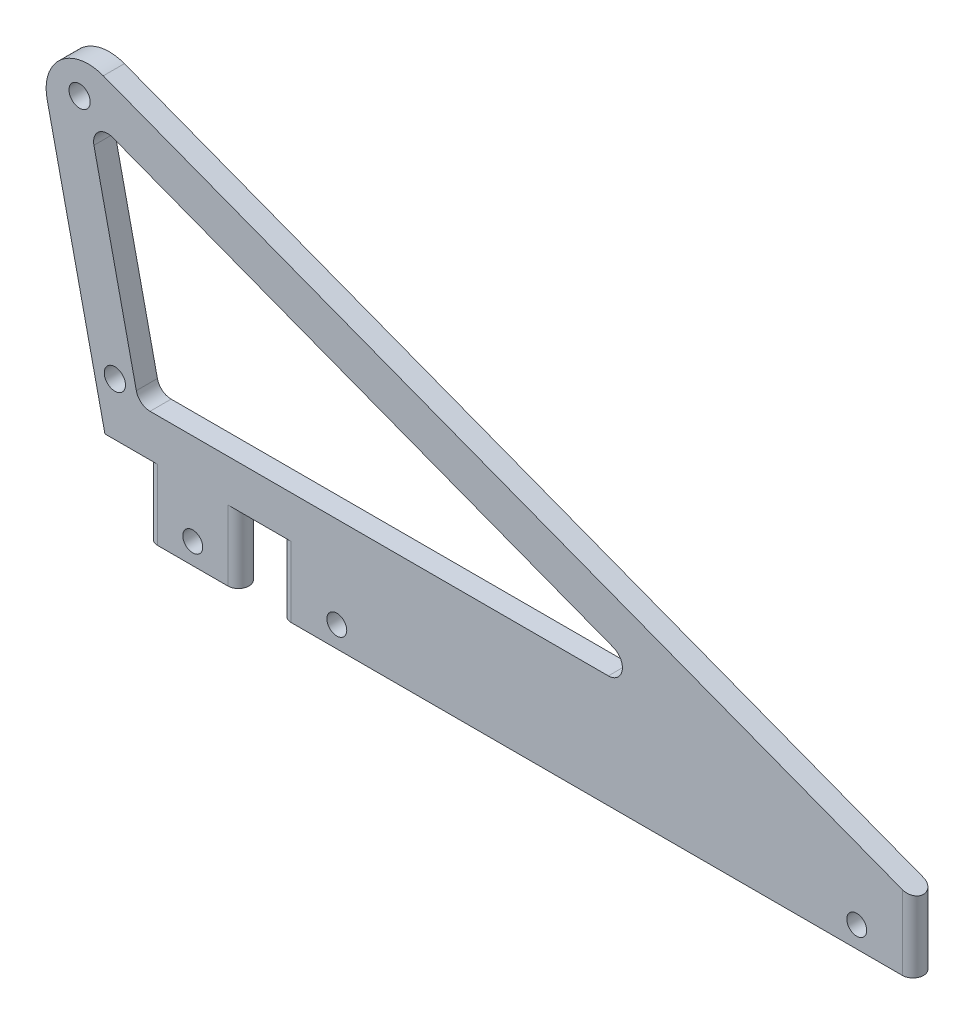
ISO-10303-21;
HEADER;
FILE_DESCRIPTION(('STEP AP214'),'2;1');
FILE_NAME('part.step','',(''),(''),'','','');
FILE_SCHEMA(('AUTOMOTIVE_DESIGN { 1 0 10303 214 1 1 1 1 }'));
ENDSEC;
DATA;
#1=APPLICATION_CONTEXT('core data for automotive mechanical design processes');
#2=APPLICATION_PROTOCOL_DEFINITION('international standard','automotive_design',2000,#1);
#3=PRODUCT_CONTEXT('',#1,'mechanical');
#4=PRODUCT('Part','Part','',(#3));
#5=PRODUCT_RELATED_PRODUCT_CATEGORY('part','',(#4));
#6=PRODUCT_DEFINITION_FORMATION('','',#4);
#7=PRODUCT_DEFINITION_CONTEXT('part definition',#1,'design');
#8=PRODUCT_DEFINITION('design','',#6,#7);
#9=PRODUCT_DEFINITION_SHAPE('','',#8);
#10=(LENGTH_UNIT() NAMED_UNIT(*) SI_UNIT(.MILLI.,.METRE.));
#11=(NAMED_UNIT(*) PLANE_ANGLE_UNIT() SI_UNIT($,.RADIAN.));
#12=(NAMED_UNIT(*) SI_UNIT($,.STERADIAN.) SOLID_ANGLE_UNIT());
#13=UNCERTAINTY_MEASURE_WITH_UNIT(LENGTH_MEASURE(1.E-05),#10,'distance_accuracy_value','');
#14=(GEOMETRIC_REPRESENTATION_CONTEXT(3) GLOBAL_UNCERTAINTY_ASSIGNED_CONTEXT((#13)) GLOBAL_UNIT_ASSIGNED_CONTEXT((#10,
#11,#12)) REPRESENTATION_CONTEXT('',''));
#15=CARTESIAN_POINT('',(0.,0.,0.));
#16=DIRECTION('',(0.,0.,1.));
#17=DIRECTION('',(1.,0.,0.));
#18=AXIS2_PLACEMENT_3D('',#15,#16,#17);
#19=CARTESIAN_POINT('',(180.18125,0.909732390125542,2.38125));
#20=DIRECTION('',(0.,1.,0.));
#21=DIRECTION('',(0.,0.,1.));
#22=AXIS2_PLACEMENT_3D('',#19,#20,#21);
#23=CYLINDRICAL_SURFACE('',#22,2.38125);
#24=DIRECTION('',(0.,1.,0.));
#25=VECTOR('',#24,1.);
#26=CARTESIAN_POINT('',(180.18125,0.,0.));
#27=LINE('',#26,#25);
#28=CARTESIAN_POINT('',(180.18125,0.909732390125538,0.));
#29=VERTEX_POINT('',#28);
#30=CARTESIAN_POINT('',(180.18125,-15.875,0.));
#31=VERTEX_POINT('',#30);
#32=EDGE_CURVE('E252',#29,#31,#27,.F.);
#33=ORIENTED_EDGE('',*,*,#32,.F.);
#34=CARTESIAN_POINT('',(180.18125,0.909732390125538,2.38125));
#35=DIRECTION('',(-0.356882282317649,-0.934149365234354,0.));
#36=DIRECTION('',(-0.934149365234354,0.356882282317649,0.));
#37=AXIS2_PLACEMENT_3D('',#34,#35,#36);
#38=ELLIPSE('',#37,2.5491105476506,2.38125);
#39=CARTESIAN_POINT('',(180.18125,0.909732390125538,4.7625));
#40=VERTEX_POINT('',#39);
#41=EDGE_CURVE('E43',#40,#29,#38,.F.);
#42=ORIENTED_EDGE('',*,*,#41,.F.);
#43=DIRECTION('',(0.,-1.,0.));
#44=VECTOR('',#43,1.);
#45=CARTESIAN_POINT('',(180.18125,0.909732390125542,4.7625));
#46=LINE('',#45,#44);
#47=CARTESIAN_POINT('',(180.18125,-15.875,4.7625));
#48=VERTEX_POINT('',#47);
#49=EDGE_CURVE('E255',#48,#40,#46,.F.);
#50=ORIENTED_EDGE('',*,*,#49,.F.);
#51=CARTESIAN_POINT('',(180.18125,-15.875,2.38125));
#52=DIRECTION('',(0.,1.,0.));
#53=DIRECTION('',(-1.,0.,0.));
#54=AXIS2_PLACEMENT_3D('',#51,#52,#53);
#55=CIRCLE('',#54,2.38125);
#56=EDGE_CURVE('E11',#31,#48,#55,.F.);
#57=ORIENTED_EDGE('',*,*,#56,.F.);
#58=EDGE_LOOP('',(#33,#42,#50,#57));
#59=FACE_BOUND('',#58,.T.);
#60=ADVANCED_FACE('F35',(#59),#23,.T.);
#61=CARTESIAN_POINT('',(42.06875,9.525,2.38125));
#62=DIRECTION('',(0.,-1.,0.));
#63=DIRECTION('',(0.,0.,-1.));
#64=AXIS2_PLACEMENT_3D('',#61,#62,#63);
#65=CYLINDRICAL_SURFACE('',#64,2.38125);
#66=DIRECTION('',(0.,1.,0.));
#67=VECTOR('',#66,1.);
#68=CARTESIAN_POINT('',(42.06875,9.525,4.7625));
#69=LINE('',#68,#67);
#70=CARTESIAN_POINT('',(42.06875,0.,4.7625));
#71=VERTEX_POINT('',#70);
#72=CARTESIAN_POINT('',(42.06875,-15.875,4.7625));
#73=VERTEX_POINT('',#72);
#74=EDGE_CURVE('E241',#71,#73,#69,.F.);
#75=ORIENTED_EDGE('',*,*,#74,.F.);
#76=CARTESIAN_POINT('',(42.06875,0.,2.38125));
#77=DIRECTION('',(0.,1.,0.));
#78=DIRECTION('',(0.,0.,1.));
#79=AXIS2_PLACEMENT_3D('',#76,#77,#78);
#80=CIRCLE('',#79,2.38125);
#81=CARTESIAN_POINT('',(42.06875,0.,0.));
#82=VERTEX_POINT('',#81);
#83=EDGE_CURVE('E249',#82,#71,#80,.T.);
#84=ORIENTED_EDGE('',*,*,#83,.F.);
#85=DIRECTION('',(0.,-1.,0.));
#86=VECTOR('',#85,1.);
#87=CARTESIAN_POINT('',(42.06875,0.,0.));
#88=LINE('',#87,#86);
#89=CARTESIAN_POINT('',(42.06875,-15.875,0.));
#90=VERTEX_POINT('',#89);
#91=EDGE_CURVE('E244',#90,#82,#88,.F.);
#92=ORIENTED_EDGE('',*,*,#91,.F.);
#93=CARTESIAN_POINT('',(42.06875,-15.875,2.38125));
#94=DIRECTION('',(0.,1.,0.));
#95=DIRECTION('',(-1.,0.,0.));
#96=AXIS2_PLACEMENT_3D('',#93,#94,#95);
#97=CIRCLE('',#96,2.38125);
#98=EDGE_CURVE('E247',#73,#90,#97,.F.);
#99=ORIENTED_EDGE('',*,*,#98,.F.);
#100=EDGE_LOOP('',(#75,#84,#92,#99));
#101=FACE_BOUND('',#100,.T.);
#102=ADVANCED_FACE('F381',(#101),#65,.T.);
#103=CARTESIAN_POINT('',(27.78125,9.525,2.38125));
#104=DIRECTION('',(0.,1.,0.));
#105=DIRECTION('',(0.,0.,1.));
#106=AXIS2_PLACEMENT_3D('',#103,#104,#105);
#107=CYLINDRICAL_SURFACE('',#106,2.38125);
#108=DIRECTION('',(0.,1.,0.));
#109=VECTOR('',#108,1.);
#110=CARTESIAN_POINT('',(27.78125,0.,0.));
#111=LINE('',#110,#109);
#112=CARTESIAN_POINT('',(27.78125,0.,0.));
#113=VERTEX_POINT('',#112);
#114=CARTESIAN_POINT('',(27.78125,-15.875,0.));
#115=VERTEX_POINT('',#114);
#116=EDGE_CURVE('E230',#113,#115,#111,.F.);
#117=ORIENTED_EDGE('',*,*,#116,.F.);
#118=CARTESIAN_POINT('',(27.78125,0.,2.38125));
#119=DIRECTION('',(0.,1.,0.));
#120=DIRECTION('',(0.,0.,1.));
#121=AXIS2_PLACEMENT_3D('',#118,#119,#120);
#122=CIRCLE('',#121,2.38125);
#123=CARTESIAN_POINT('',(27.78125,0.,4.7625));
#124=VERTEX_POINT('',#123);
#125=EDGE_CURVE('E238',#124,#113,#122,.T.);
#126=ORIENTED_EDGE('',*,*,#125,.F.);
#127=DIRECTION('',(0.,-1.,0.));
#128=VECTOR('',#127,1.);
#129=CARTESIAN_POINT('',(27.78125,9.525,4.7625));
#130=LINE('',#129,#128);
#131=CARTESIAN_POINT('',(27.78125,-15.875,4.7625));
#132=VERTEX_POINT('',#131);
#133=EDGE_CURVE('E233',#132,#124,#130,.F.);
#134=ORIENTED_EDGE('',*,*,#133,.F.);
#135=CARTESIAN_POINT('',(27.78125,-15.875,2.38125));
#136=DIRECTION('',(0.,1.,0.));
#137=DIRECTION('',(0.,0.,1.));
#138=AXIS2_PLACEMENT_3D('',#135,#136,#137);
#139=CIRCLE('',#138,2.38125);
#140=EDGE_CURVE('E236',#115,#132,#139,.F.);
#141=ORIENTED_EDGE('',*,*,#140,.F.);
#142=EDGE_LOOP('',(#117,#126,#134,#141));
#143=FACE_BOUND('',#142,.T.);
#144=ADVANCED_FACE('F385',(#143),#107,.T.);
#145=CARTESIAN_POINT('',(11.90625,9.525,2.38125));
#146=DIRECTION('',(0.,-1.,0.));
#147=DIRECTION('',(0.,0.,-1.));
#148=AXIS2_PLACEMENT_3D('',#145,#146,#147);
#149=CYLINDRICAL_SURFACE('',#148,2.38125);
#150=DIRECTION('',(0.,1.,0.));
#151=VECTOR('',#150,1.);
#152=CARTESIAN_POINT('',(11.90625,9.525,4.7625));
#153=LINE('',#152,#151);
#154=CARTESIAN_POINT('',(11.90625,0.,4.7625));
#155=VERTEX_POINT('',#154);
#156=CARTESIAN_POINT('',(11.90625,-15.875,4.7625));
#157=VERTEX_POINT('',#156);
#158=EDGE_CURVE('E222',#155,#157,#153,.F.);
#159=ORIENTED_EDGE('',*,*,#158,.F.);
#160=CARTESIAN_POINT('',(11.90625,0.,2.38125));
#161=DIRECTION('',(0.,1.,0.));
#162=DIRECTION('',(0.,0.,1.));
#163=AXIS2_PLACEMENT_3D('',#160,#161,#162);
#164=CIRCLE('',#163,2.38125);
#165=CARTESIAN_POINT('',(11.90625,0.,0.));
#166=VERTEX_POINT('',#165);
#167=EDGE_CURVE('E171',#166,#155,#164,.T.);
#168=ORIENTED_EDGE('',*,*,#167,.F.);
#169=DIRECTION('',(0.,-1.,0.));
#170=VECTOR('',#169,1.);
#171=CARTESIAN_POINT('',(11.90625,0.,0.));
#172=LINE('',#171,#170);
#173=CARTESIAN_POINT('',(11.90625,-15.875,0.));
#174=VERTEX_POINT('',#173);
#175=EDGE_CURVE('E224',#174,#166,#172,.F.);
#176=ORIENTED_EDGE('',*,*,#175,.F.);
#177=CARTESIAN_POINT('',(11.90625,-15.875,2.38125));
#178=DIRECTION('',(0.,1.,0.));
#179=DIRECTION('',(0.,0.,1.));
#180=AXIS2_PLACEMENT_3D('',#177,#178,#179);
#181=CIRCLE('',#180,2.38125);
#182=EDGE_CURVE('E227',#157,#174,#181,.F.);
#183=ORIENTED_EDGE('',*,*,#182,.F.);
#184=EDGE_LOOP('',(#159,#168,#176,#183));
#185=FACE_BOUND('',#184,.T.);
#186=ADVANCED_FACE('F390',(#185),#149,.T.);
#187=CARTESIAN_POINT('',(-16.8931332933918,76.2,4.7625));
#188=DIRECTION('',(0.976296007119934,0.2164396139381,0.));
#189=DIRECTION('',(-0.2164396139381,0.976296007119934,0.));
#190=AXIS2_PLACEMENT_3D('',#187,#188,#189);
#191=PLANE('',#190);
#192=DIRECTION('',(0.2164396139381,-0.976296007119934,0.));
#193=VECTOR('',#192,1.);
#194=CARTESIAN_POINT('',(-16.8931332933918,76.2,4.7625));
#195=LINE('',#194,#193);
#196=CARTESIAN_POINT('',(-13.0636416980499,58.9262796961887,4.7625));
#197=VERTEX_POINT('',#196);
#198=CARTESIAN_POINT('',(0.,0.,4.7625));
#199=VERTEX_POINT('',#198);
#200=EDGE_CURVE('E151',#197,#199,#195,.T.);
#201=ORIENTED_EDGE('',*,*,#200,.F.);
#202=DIRECTION('',(0.,0.,-1.));
#203=VECTOR('',#202,1.);
#204=CARTESIAN_POINT('',(-13.0636416980499,58.9262796961887,4.7625));
#205=LINE('',#204,#203);
#206=CARTESIAN_POINT('',(-13.0636416980499,58.9262796961887,0.));
#207=VERTEX_POINT('',#206);
#208=EDGE_CURVE('E213',#197,#207,#205,.T.);
#209=ORIENTED_EDGE('',*,*,#208,.T.);
#210=DIRECTION('',(0.2164396139381,-0.976296007119934,0.));
#211=VECTOR('',#210,1.);
#212=CARTESIAN_POINT('',(-16.8931332933918,76.2,0.));
#213=LINE('',#212,#211);
#214=CARTESIAN_POINT('',(0.,0.,0.));
#215=VERTEX_POINT('',#214);
#216=EDGE_CURVE('E177',#207,#215,#213,.T.);
#217=ORIENTED_EDGE('',*,*,#216,.T.);
#218=DIRECTION('',(0.,0.,-1.));
#219=VECTOR('',#218,1.);
#220=CARTESIAN_POINT('',(0.,0.,4.7625));
#221=LINE('',#220,#219);
#222=EDGE_CURVE('E169',#199,#215,#221,.T.);
#223=ORIENTED_EDGE('',*,*,#222,.F.);
#224=EDGE_LOOP('',(#201,#209,#217,#223));
#225=FACE_BOUND('',#224,.T.);
#226=ADVANCED_FACE('F175',(#225),#191,.F.);
#227=CARTESIAN_POINT('',(0.,0.,4.7625));
#228=DIRECTION('',(0.,1.,0.));
#229=DIRECTION('',(0.,0.,1.));
#230=AXIS2_PLACEMENT_3D('',#227,#228,#229);
#231=PLANE('',#230);
#232=DIRECTION('',(1.,0.,0.));
#233=VECTOR('',#232,1.);
#234=CARTESIAN_POINT('',(0.,0.,0.));
#235=LINE('',#234,#233);
#236=EDGE_CURVE('E271',#215,#166,#235,.T.);
#237=ORIENTED_EDGE('',*,*,#236,.T.);
#238=ORIENTED_EDGE('',*,*,#167,.T.);
#239=DIRECTION('',(1.,0.,0.));
#240=VECTOR('',#239,1.);
#241=CARTESIAN_POINT('',(0.,0.,4.7625));
#242=LINE('',#241,#240);
#243=EDGE_CURVE('E156',#199,#155,#242,.T.);
#244=ORIENTED_EDGE('',*,*,#243,.F.);
#245=ORIENTED_EDGE('',*,*,#222,.T.);
#246=EDGE_LOOP('',(#237,#238,#244,#245));
#247=FACE_BOUND('',#246,.T.);
#248=ADVANCED_FACE('F168',(#247),#231,.F.);
#249=CARTESIAN_POINT('',(9.525,-15.875,4.7625));
#250=DIRECTION('',(0.,1.,0.));
#251=DIRECTION('',(0.,0.,1.));
#252=AXIS2_PLACEMENT_3D('',#249,#250,#251);
#253=PLANE('',#252);
#254=DIRECTION('',(1.,0.,0.));
#255=VECTOR('',#254,1.);
#256=CARTESIAN_POINT('',(9.525,-15.875,0.));
#257=LINE('',#256,#255);
#258=EDGE_CURVE('E266',#174,#115,#257,.T.);
#259=ORIENTED_EDGE('',*,*,#258,.T.);
#260=ORIENTED_EDGE('',*,*,#140,.T.);
#261=DIRECTION('',(1.,0.,0.));
#262=VECTOR('',#261,1.);
#263=CARTESIAN_POINT('',(9.525,-15.875,4.7625));
#264=LINE('',#263,#262);
#265=EDGE_CURVE('E173',#157,#132,#264,.T.);
#266=ORIENTED_EDGE('',*,*,#265,.F.);
#267=ORIENTED_EDGE('',*,*,#182,.T.);
#268=EDGE_LOOP('',(#259,#260,#266,#267));
#269=FACE_BOUND('',#268,.T.);
#270=ADVANCED_FACE('F413',(#269),#253,.F.);
#271=CARTESIAN_POINT('',(30.1625,0.,4.7625));
#272=DIRECTION('',(0.,1.,0.));
#273=DIRECTION('',(0.,0.,1.));
#274=AXIS2_PLACEMENT_3D('',#271,#272,#273);
#275=PLANE('',#274);
#276=DIRECTION('',(1.,0.,0.));
#277=VECTOR('',#276,1.);
#278=CARTESIAN_POINT('',(30.1625,0.,0.));
#279=LINE('',#278,#277);
#280=EDGE_CURVE('E265',#113,#82,#279,.T.);
#281=ORIENTED_EDGE('',*,*,#280,.T.);
#282=ORIENTED_EDGE('',*,*,#83,.T.);
#283=DIRECTION('',(1.,0.,0.));
#284=VECTOR('',#283,1.);
#285=CARTESIAN_POINT('',(30.1625,0.,4.7625));
#286=LINE('',#285,#284);
#287=EDGE_CURVE('E276',#124,#71,#286,.T.);
#288=ORIENTED_EDGE('',*,*,#287,.F.);
#289=ORIENTED_EDGE('',*,*,#125,.T.);
#290=EDGE_LOOP('',(#281,#282,#288,#289));
#291=FACE_BOUND('',#290,.T.);
#292=ADVANCED_FACE('F420',(#291),#275,.F.);
#293=CARTESIAN_POINT('',(39.6875,-15.875,4.7625));
#294=DIRECTION('',(0.,1.,0.));
#295=DIRECTION('',(-1.,0.,0.));
#296=AXIS2_PLACEMENT_3D('',#293,#294,#295);
#297=PLANE('',#296);
#298=DIRECTION('',(1.,0.,0.));
#299=VECTOR('',#298,1.);
#300=CARTESIAN_POINT('',(39.6875,-15.875,0.));
#301=LINE('',#300,#299);
#302=EDGE_CURVE('E264',#90,#31,#301,.T.);
#303=ORIENTED_EDGE('',*,*,#302,.T.);
#304=ORIENTED_EDGE('',*,*,#56,.T.);
#305=DIRECTION('',(1.,0.,0.));
#306=VECTOR('',#305,1.);
#307=CARTESIAN_POINT('',(39.6875,-15.875,4.7625));
#308=LINE('',#307,#306);
#309=EDGE_CURVE('E184',#73,#48,#308,.T.);
#310=ORIENTED_EDGE('',*,*,#309,.F.);
#311=ORIENTED_EDGE('',*,*,#98,.T.);
#312=EDGE_LOOP('',(#303,#304,#310,#311));
#313=FACE_BOUND('',#312,.T.);
#314=ADVANCED_FACE('F422',(#313),#297,.F.);
#315=CARTESIAN_POINT('',(182.5625,0.,4.7625));
#316=DIRECTION('',(-0.356882282317649,-0.934149365234354,0.));
#317=DIRECTION('',(0.934149365234354,-0.356882282317649,0.));
#318=AXIS2_PLACEMENT_3D('',#315,#316,#317);
#319=PLANE('',#318);
#320=DIRECTION('',(-0.934149365234354,0.356882282317649,0.));
#321=VECTOR('',#320,1.);
#322=CARTESIAN_POINT('',(182.5625,0.,4.7625));
#323=LINE('',#322,#321);
#324=CARTESIAN_POINT('',(-0.365118491156918,69.8856397228063,4.7625));
#325=VERTEX_POINT('',#324);
#326=EDGE_CURVE('E180',#40,#325,#323,.T.);
#327=ORIENTED_EDGE('',*,*,#326,.F.);
#328=ORIENTED_EDGE('',*,*,#41,.T.);
#329=DIRECTION('',(-0.934149365234354,0.356882282317649,0.));
#330=VECTOR('',#329,1.);
#331=CARTESIAN_POINT('',(182.5625,0.,0.));
#332=LINE('',#331,#330);
#333=CARTESIAN_POINT('',(-0.365118491156918,69.8856397228063,0.));
#334=VERTEX_POINT('',#333);
#335=EDGE_CURVE('E164',#29,#334,#332,.T.);
#336=ORIENTED_EDGE('',*,*,#335,.T.);
#337=DIRECTION('',(0.,0.,-1.));
#338=VECTOR('',#337,1.);
#339=CARTESIAN_POINT('',(-0.365118491156918,69.8856397228063,4.7625));
#340=LINE('',#339,#338);
#341=EDGE_CURVE('E218',#334,#325,#340,.F.);
#342=ORIENTED_EDGE('',*,*,#341,.T.);
#343=EDGE_LOOP('',(#327,#328,#336,#342));
#344=FACE_BOUND('',#343,.T.);
#345=ADVANCED_FACE('F258',(#344),#319,.F.);
#346=CARTESIAN_POINT('',(0.,0.,4.7625));
#347=DIRECTION('',(0.,0.,1.));
#348=DIRECTION('',(1.,0.,0.));
#349=AXIS2_PLACEMENT_3D('',#346,#347,#348);
#350=PLANE('',#349);
#351=CARTESIAN_POINT('',(19.84375,-11.1125,4.7625));
#352=DIRECTION('',(0.,0.,1.));
#353=DIRECTION('',(1.,0.,0.));
#354=AXIS2_PLACEMENT_3D('',#351,#352,#353);
#355=CIRCLE('',#354,2.2479);
#356=CARTESIAN_POINT('',(22.09165,-11.1125,4.7625));
#357=VERTEX_POINT('',#356);
#358=EDGE_CURVE('E324',#357,#357,#355,.T.);
#359=ORIENTED_EDGE('',*,*,#358,.F.);
#360=EDGE_LOOP('',(#359));
#361=FACE_BOUND('',#360,.T.);
#362=CARTESIAN_POINT('',(52.3875,-11.1125,4.7625));
#363=DIRECTION('',(0.,0.,1.));
#364=DIRECTION('',(1.,0.,0.));
#365=AXIS2_PLACEMENT_3D('',#362,#363,#364);
#366=CIRCLE('',#365,2.2479);
#367=CARTESIAN_POINT('',(54.6354,-11.1125,4.7625));
#368=VERTEX_POINT('',#367);
#369=EDGE_CURVE('E318',#368,#368,#366,.T.);
#370=ORIENTED_EDGE('',*,*,#369,.F.);
#371=EDGE_LOOP('',(#370));
#372=FACE_BOUND('',#371,.T.);
#373=CARTESIAN_POINT('',(169.8625,-11.1125,4.7625));
#374=DIRECTION('',(0.,0.,1.));
#375=DIRECTION('',(1.,0.,0.));
#376=AXIS2_PLACEMENT_3D('',#373,#374,#375);
#377=CIRCLE('',#376,2.2479);
#378=CARTESIAN_POINT('',(172.1104,-11.1125,4.7625));
#379=VERTEX_POINT('',#378);
#380=EDGE_CURVE('E312',#379,#379,#377,.T.);
#381=ORIENTED_EDGE('',*,*,#380,.F.);
#382=EDGE_LOOP('',(#381));
#383=FACE_BOUND('',#382,.T.);
#384=CARTESIAN_POINT('',(-5.72515332999664,63.2597505333476,4.7625));
#385=DIRECTION('',(0.,0.,1.));
#386=DIRECTION('',(1.,0.,0.));
#387=AXIS2_PLACEMENT_3D('',#384,#385,#386);
#388=CIRCLE('',#387,2.4003);
#389=CARTESIAN_POINT('',(-3.32485332999664,63.2597505333476,4.7625));
#390=VERTEX_POINT('',#389);
#391=EDGE_CURVE('E306',#390,#390,#388,.T.);
#392=ORIENTED_EDGE('',*,*,#391,.F.);
#393=EDGE_LOOP('',(#392));
#394=FACE_BOUND('',#393,.T.);
#395=CARTESIAN_POINT('',(2.24442452402155,11.8798830405005,4.7625));
#396=DIRECTION('',(0.,0.,1.));
#397=DIRECTION('',(1.,0.,0.));
#398=AXIS2_PLACEMENT_3D('',#395,#396,#397);
#399=CIRCLE('',#398,2.4003);
#400=CARTESIAN_POINT('',(4.64472452402155,11.8798830405005,4.7625));
#401=VERTEX_POINT('',#400);
#402=EDGE_CURVE('E300',#401,#401,#399,.T.);
#403=ORIENTED_EDGE('',*,*,#402,.F.);
#404=EDGE_LOOP('',(#403));
#405=FACE_BOUND('',#404,.T.);
#406=DIRECTION('',(0.2164396139381,-0.976296007119934,0.));
#407=VECTOR('',#406,1.);
#408=CARTESIAN_POINT('',(-3.7644222302325,60.9878670189491,4.7625));
#409=LINE('',#408,#407);
#410=CARTESIAN_POINT('',(-2.48792503178521,55.229960251012,4.7625));
#411=VERTEX_POINT('',#410);
#412=CARTESIAN_POINT('',(7.09308779362317,12.0128042257465,4.7625));
#413=VERTEX_POINT('',#412);
#414=EDGE_CURVE('E287',#411,#413,#409,.T.);
#415=ORIENTED_EDGE('',*,*,#414,.F.);
#416=CARTESIAN_POINT('',(0.611814790820582,55.9171560252655,4.7625));
#417=DIRECTION('',(0.,0.,1.));
#418=DIRECTION('',(1.,0.,0.));
#419=AXIS2_PLACEMENT_3D('',#416,#417,#418);
#420=CIRCLE('',#419,3.175);
#421=CARTESIAN_POINT('',(1.74491603717908,58.8830802598846,4.7625));
#422=VERTEX_POINT('',#421);
#423=EDGE_CURVE('E209',#411,#422,#420,.F.);
#424=ORIENTED_EDGE('',*,*,#423,.T.);
#425=DIRECTION('',(-0.934149365234354,0.356882282317649,0.));
#426=VECTOR('',#425,1.);
#427=CARTESIAN_POINT('',(130.941072945071,9.525,4.7625));
#428=LINE('',#427,#426);
#429=CARTESIAN_POINT('',(114.867031839786,15.6659242346191,4.7625));
#430=VERTEX_POINT('',#429);
#431=EDGE_CURVE('E280',#430,#422,#428,.T.);
#432=ORIENTED_EDGE('',*,*,#431,.F.);
#433=CARTESIAN_POINT('',(113.733930593428,12.7,4.7625));
#434=DIRECTION('',(0.,0.,1.));
#435=DIRECTION('',(1.,0.,0.));
#436=AXIS2_PLACEMENT_3D('',#433,#434,#435);
#437=CIRCLE('',#436,3.175);
#438=CARTESIAN_POINT('',(113.733930593428,9.525,4.7625));
#439=VERTEX_POINT('',#438);
#440=EDGE_CURVE('E205',#430,#439,#437,.F.);
#441=ORIENTED_EDGE('',*,*,#440,.T.);
#442=DIRECTION('',(1.,0.,0.));
#443=VECTOR('',#442,1.);
#444=CARTESIAN_POINT('',(7.64462071217172,9.525,4.7625));
#445=LINE('',#444,#443);
#446=CARTESIAN_POINT('',(10.192827616229,9.525,4.7625));
#447=VERTEX_POINT('',#446);
#448=EDGE_CURVE('E284',#447,#439,#445,.T.);
#449=ORIENTED_EDGE('',*,*,#448,.F.);
#450=CARTESIAN_POINT('',(10.192827616229,12.7,4.7625));
#451=DIRECTION('',(0.,0.,1.));
#452=DIRECTION('',(1.,0.,0.));
#453=AXIS2_PLACEMENT_3D('',#450,#451,#452);
#454=CIRCLE('',#453,3.175);
#455=EDGE_CURVE('E201',#447,#413,#454,.F.);
#456=ORIENTED_EDGE('',*,*,#455,.T.);
#457=EDGE_LOOP('',(#415,#424,#432,#441,#449,#456));
#458=FACE_BOUND('',#457,.T.);
#459=ORIENTED_EDGE('',*,*,#309,.T.);
#460=ORIENTED_EDGE('',*,*,#49,.T.);
#461=ORIENTED_EDGE('',*,*,#326,.T.);
#462=CARTESIAN_POINT('',(-3.76442223023252,60.9878670189491,4.7625));
#463=DIRECTION('',(0.,0.,1.));
#464=DIRECTION('',(1.,0.,0.));
#465=AXIS2_PLACEMENT_3D('',#462,#463,#464);
#466=CIRCLE('',#465,9.525);
#467=EDGE_CURVE('E159',#325,#197,#466,.T.);
#468=ORIENTED_EDGE('',*,*,#467,.T.);
#469=ORIENTED_EDGE('',*,*,#200,.T.);
#470=ORIENTED_EDGE('',*,*,#243,.T.);
#471=ORIENTED_EDGE('',*,*,#158,.T.);
#472=ORIENTED_EDGE('',*,*,#265,.T.);
#473=ORIENTED_EDGE('',*,*,#133,.T.);
#474=ORIENTED_EDGE('',*,*,#287,.T.);
#475=ORIENTED_EDGE('',*,*,#74,.T.);
#476=EDGE_LOOP('',(#459,#460,#461,#468,#469,#470,#471,#472,#473,#474,#475));
#477=FACE_BOUND('',#476,.T.);
#478=ADVANCED_FACE('F154',(#361,#372,#383,#394,#405,#458,#477),#350,.T.);
#479=CARTESIAN_POINT('',(0.,0.,0.));
#480=DIRECTION('',(0.,0.,1.));
#481=DIRECTION('',(1.,0.,0.));
#482=AXIS2_PLACEMENT_3D('',#479,#480,#481);
#483=PLANE('',#482);
#484=CARTESIAN_POINT('',(19.84375,-11.1125,0.));
#485=DIRECTION('',(0.,0.,1.));
#486=DIRECTION('',(1.,0.,0.));
#487=AXIS2_PLACEMENT_3D('',#484,#485,#486);
#488=CIRCLE('',#487,2.2479);
#489=CARTESIAN_POINT('',(22.09165,-11.1125,0.));
#490=VERTEX_POINT('',#489);
#491=EDGE_CURVE('E321',#490,#490,#488,.T.);
#492=ORIENTED_EDGE('',*,*,#491,.T.);
#493=EDGE_LOOP('',(#492));
#494=FACE_BOUND('',#493,.T.);
#495=CARTESIAN_POINT('',(52.3875,-11.1125,0.));
#496=DIRECTION('',(0.,0.,1.));
#497=DIRECTION('',(1.,0.,0.));
#498=AXIS2_PLACEMENT_3D('',#495,#496,#497);
#499=CIRCLE('',#498,2.2479);
#500=CARTESIAN_POINT('',(54.6354,-11.1125,0.));
#501=VERTEX_POINT('',#500);
#502=EDGE_CURVE('E315',#501,#501,#499,.T.);
#503=ORIENTED_EDGE('',*,*,#502,.T.);
#504=EDGE_LOOP('',(#503));
#505=FACE_BOUND('',#504,.T.);
#506=CARTESIAN_POINT('',(169.8625,-11.1125,0.));
#507=DIRECTION('',(0.,0.,1.));
#508=DIRECTION('',(1.,0.,0.));
#509=AXIS2_PLACEMENT_3D('',#506,#507,#508);
#510=CIRCLE('',#509,2.2479);
#511=CARTESIAN_POINT('',(172.1104,-11.1125,0.));
#512=VERTEX_POINT('',#511);
#513=EDGE_CURVE('E309',#512,#512,#510,.T.);
#514=ORIENTED_EDGE('',*,*,#513,.T.);
#515=EDGE_LOOP('',(#514));
#516=FACE_BOUND('',#515,.T.);
#517=CARTESIAN_POINT('',(-5.72515332999664,63.2597505333476,0.));
#518=DIRECTION('',(0.,0.,1.));
#519=DIRECTION('',(1.,0.,0.));
#520=AXIS2_PLACEMENT_3D('',#517,#518,#519);
#521=CIRCLE('',#520,2.4003);
#522=CARTESIAN_POINT('',(-3.32485332999664,63.2597505333476,0.));
#523=VERTEX_POINT('',#522);
#524=EDGE_CURVE('E303',#523,#523,#521,.T.);
#525=ORIENTED_EDGE('',*,*,#524,.T.);
#526=EDGE_LOOP('',(#525));
#527=FACE_BOUND('',#526,.T.);
#528=CARTESIAN_POINT('',(2.24442452402155,11.8798830405005,0.));
#529=DIRECTION('',(0.,0.,1.));
#530=DIRECTION('',(1.,0.,0.));
#531=AXIS2_PLACEMENT_3D('',#528,#529,#530);
#532=CIRCLE('',#531,2.4003);
#533=CARTESIAN_POINT('',(4.64472452402155,11.8798830405005,0.));
#534=VERTEX_POINT('',#533);
#535=EDGE_CURVE('E290',#534,#534,#532,.T.);
#536=ORIENTED_EDGE('',*,*,#535,.T.);
#537=EDGE_LOOP('',(#536));
#538=FACE_BOUND('',#537,.T.);
#539=DIRECTION('',(1.,0.,0.));
#540=VECTOR('',#539,1.);
#541=CARTESIAN_POINT('',(7.64462071217172,9.525,0.));
#542=LINE('',#541,#540);
#543=CARTESIAN_POINT('',(10.192827616229,9.525,0.));
#544=VERTEX_POINT('',#543);
#545=CARTESIAN_POINT('',(113.733930593428,9.525,0.));
#546=VERTEX_POINT('',#545);
#547=EDGE_CURVE('E293',#544,#546,#542,.T.);
#548=ORIENTED_EDGE('',*,*,#547,.T.);
#549=CARTESIAN_POINT('',(113.733930593428,12.7,0.));
#550=DIRECTION('',(0.,0.,1.));
#551=DIRECTION('',(1.,0.,0.));
#552=AXIS2_PLACEMENT_3D('',#549,#550,#551);
#553=CIRCLE('',#552,3.175);
#554=CARTESIAN_POINT('',(114.867031839786,15.6659242346191,0.));
#555=VERTEX_POINT('',#554);
#556=EDGE_CURVE('E207',#546,#555,#553,.T.);
#557=ORIENTED_EDGE('',*,*,#556,.T.);
#558=DIRECTION('',(-0.934149365234354,0.356882282317649,0.));
#559=VECTOR('',#558,1.);
#560=CARTESIAN_POINT('',(130.941072945071,9.525,0.));
#561=LINE('',#560,#559);
#562=CARTESIAN_POINT('',(1.74491603717908,58.8830802598846,0.));
#563=VERTEX_POINT('',#562);
#564=EDGE_CURVE('E273',#555,#563,#561,.T.);
#565=ORIENTED_EDGE('',*,*,#564,.T.);
#566=CARTESIAN_POINT('',(0.611814790820582,55.9171560252655,0.));
#567=DIRECTION('',(0.,0.,1.));
#568=DIRECTION('',(1.,0.,0.));
#569=AXIS2_PLACEMENT_3D('',#566,#567,#568);
#570=CIRCLE('',#569,3.175);
#571=CARTESIAN_POINT('',(-2.48792503178521,55.229960251012,0.));
#572=VERTEX_POINT('',#571);
#573=EDGE_CURVE('E211',#563,#572,#570,.T.);
#574=ORIENTED_EDGE('',*,*,#573,.T.);
#575=DIRECTION('',(0.2164396139381,-0.976296007119934,0.));
#576=VECTOR('',#575,1.);
#577=CARTESIAN_POINT('',(-3.7644222302325,60.9878670189491,0.));
#578=LINE('',#577,#576);
#579=CARTESIAN_POINT('',(7.09308779362317,12.0128042257465,0.));
#580=VERTEX_POINT('',#579);
#581=EDGE_CURVE('E283',#572,#580,#578,.T.);
#582=ORIENTED_EDGE('',*,*,#581,.T.);
#583=CARTESIAN_POINT('',(10.192827616229,12.7,0.));
#584=DIRECTION('',(0.,0.,1.));
#585=DIRECTION('',(1.,0.,0.));
#586=AXIS2_PLACEMENT_3D('',#583,#584,#585);
#587=CIRCLE('',#586,3.175);
#588=EDGE_CURVE('E203',#580,#544,#587,.T.);
#589=ORIENTED_EDGE('',*,*,#588,.T.);
#590=EDGE_LOOP('',(#548,#557,#565,#574,#582,#589));
#591=FACE_BOUND('',#590,.T.);
#592=ORIENTED_EDGE('',*,*,#335,.F.);
#593=ORIENTED_EDGE('',*,*,#32,.T.);
#594=ORIENTED_EDGE('',*,*,#302,.F.);
#595=ORIENTED_EDGE('',*,*,#91,.T.);
#596=ORIENTED_EDGE('',*,*,#280,.F.);
#597=ORIENTED_EDGE('',*,*,#116,.T.);
#598=ORIENTED_EDGE('',*,*,#258,.F.);
#599=ORIENTED_EDGE('',*,*,#175,.T.);
#600=ORIENTED_EDGE('',*,*,#236,.F.);
#601=ORIENTED_EDGE('',*,*,#216,.F.);
#602=CARTESIAN_POINT('',(-3.76442223023252,60.9878670189491,0.));
#603=DIRECTION('',(0.,0.,1.));
#604=DIRECTION('',(1.,0.,0.));
#605=AXIS2_PLACEMENT_3D('',#602,#603,#604);
#606=CIRCLE('',#605,9.525);
#607=EDGE_CURVE('E215',#207,#334,#606,.F.);
#608=ORIENTED_EDGE('',*,*,#607,.T.);
#609=EDGE_LOOP('',(#592,#593,#594,#595,#596,#597,#598,#599,#600,#601,#608));
#610=FACE_BOUND('',#609,.T.);
#611=ADVANCED_FACE('F262',(#494,#505,#516,#527,#538,#591,#610),#483,.F.);
#612=CARTESIAN_POINT('',(-3.7644222302325,60.9878670189491,0.));
#613=DIRECTION('',(-0.976296007119934,-0.2164396139381,0.));
#614=DIRECTION('',(0.2164396139381,-0.976296007119934,0.));
#615=AXIS2_PLACEMENT_3D('',#612,#613,#614);
#616=PLANE('',#615);
#617=ORIENTED_EDGE('',*,*,#414,.T.);
#618=DIRECTION('',(0.,0.,1.));
#619=VECTOR('',#618,1.);
#620=CARTESIAN_POINT('',(7.09308779362317,12.0128042257465,0.));
#621=LINE('',#620,#619);
#622=EDGE_CURVE('E194',#413,#580,#621,.F.);
#623=ORIENTED_EDGE('',*,*,#622,.T.);
#624=ORIENTED_EDGE('',*,*,#581,.F.);
#625=DIRECTION('',(0.,0.,1.));
#626=VECTOR('',#625,1.);
#627=CARTESIAN_POINT('',(-2.48792503178521,55.229960251012,4.7625));
#628=LINE('',#627,#626);
#629=EDGE_CURVE('E191',#572,#411,#628,.T.);
#630=ORIENTED_EDGE('',*,*,#629,.T.);
#631=EDGE_LOOP('',(#617,#623,#624,#630));
#632=FACE_BOUND('',#631,.T.);
#633=ADVANCED_FACE('F346',(#632),#616,.F.);
#634=CARTESIAN_POINT('',(130.941072945071,9.525,0.));
#635=DIRECTION('',(0.356882282317649,0.934149365234354,0.));
#636=DIRECTION('',(-0.934149365234354,0.356882282317649,0.));
#637=AXIS2_PLACEMENT_3D('',#634,#635,#636);
#638=PLANE('',#637);
#639=ORIENTED_EDGE('',*,*,#564,.F.);
#640=DIRECTION('',(0.,0.,1.));
#641=VECTOR('',#640,1.);
#642=CARTESIAN_POINT('',(114.867031839786,15.6659242346191,4.7625));
#643=LINE('',#642,#641);
#644=EDGE_CURVE('E198',#555,#430,#643,.T.);
#645=ORIENTED_EDGE('',*,*,#644,.T.);
#646=ORIENTED_EDGE('',*,*,#431,.T.);
#647=DIRECTION('',(0.,0.,1.));
#648=VECTOR('',#647,1.);
#649=CARTESIAN_POINT('',(1.74491603717912,58.8830802598846,0.));
#650=LINE('',#649,#648);
#651=EDGE_CURVE('E196',#422,#563,#650,.F.);
#652=ORIENTED_EDGE('',*,*,#651,.T.);
#653=EDGE_LOOP('',(#639,#645,#646,#652));
#654=FACE_BOUND('',#653,.T.);
#655=ADVANCED_FACE('F365',(#654),#638,.F.);
#656=CARTESIAN_POINT('',(7.64462071217172,9.525,0.));
#657=DIRECTION('',(0.,-1.,0.));
#658=DIRECTION('',(1.,0.,0.));
#659=AXIS2_PLACEMENT_3D('',#656,#657,#658);
#660=PLANE('',#659);
#661=ORIENTED_EDGE('',*,*,#547,.F.);
#662=DIRECTION('',(0.,0.,1.));
#663=VECTOR('',#662,1.);
#664=CARTESIAN_POINT('',(10.192827616229,9.525,4.7625));
#665=LINE('',#664,#663);
#666=EDGE_CURVE('E182',#544,#447,#665,.T.);
#667=ORIENTED_EDGE('',*,*,#666,.T.);
#668=ORIENTED_EDGE('',*,*,#448,.T.);
#669=DIRECTION('',(0.,0.,1.));
#670=VECTOR('',#669,1.);
#671=CARTESIAN_POINT('',(113.733930593428,9.525,0.));
#672=LINE('',#671,#670);
#673=EDGE_CURVE('E179',#439,#546,#672,.F.);
#674=ORIENTED_EDGE('',*,*,#673,.T.);
#675=EDGE_LOOP('',(#661,#667,#668,#674));
#676=FACE_BOUND('',#675,.T.);
#677=ADVANCED_FACE('F357',(#676),#660,.F.);
#678=CARTESIAN_POINT('',(10.192827616229,12.7,0.));
#679=DIRECTION('',(0.,0.,-1.));
#680=DIRECTION('',(-1.,0.,0.));
#681=AXIS2_PLACEMENT_3D('',#678,#679,#680);
#682=CYLINDRICAL_SURFACE('',#681,3.175);
#683=ORIENTED_EDGE('',*,*,#588,.F.);
#684=ORIENTED_EDGE('',*,*,#622,.F.);
#685=ORIENTED_EDGE('',*,*,#455,.F.);
#686=ORIENTED_EDGE('',*,*,#666,.F.);
#687=EDGE_LOOP('',(#683,#684,#685,#686));
#688=FACE_BOUND('',#687,.T.);
#689=ADVANCED_FACE('F351',(#688),#682,.F.);
#690=CARTESIAN_POINT('',(113.733930593428,12.7,0.));
#691=DIRECTION('',(0.,0.,-1.));
#692=DIRECTION('',(-1.,0.,0.));
#693=AXIS2_PLACEMENT_3D('',#690,#691,#692);
#694=CYLINDRICAL_SURFACE('',#693,3.175);
#695=ORIENTED_EDGE('',*,*,#556,.F.);
#696=ORIENTED_EDGE('',*,*,#673,.F.);
#697=ORIENTED_EDGE('',*,*,#440,.F.);
#698=ORIENTED_EDGE('',*,*,#644,.F.);
#699=EDGE_LOOP('',(#695,#696,#697,#698));
#700=FACE_BOUND('',#699,.T.);
#701=ADVANCED_FACE('F360',(#700),#694,.F.);
#702=CARTESIAN_POINT('',(0.611814790820582,55.9171560252655,0.));
#703=DIRECTION('',(0.,0.,-1.));
#704=DIRECTION('',(-1.,0.,0.));
#705=AXIS2_PLACEMENT_3D('',#702,#703,#704);
#706=CYLINDRICAL_SURFACE('',#705,3.175);
#707=ORIENTED_EDGE('',*,*,#573,.F.);
#708=ORIENTED_EDGE('',*,*,#651,.F.);
#709=ORIENTED_EDGE('',*,*,#423,.F.);
#710=ORIENTED_EDGE('',*,*,#629,.F.);
#711=EDGE_LOOP('',(#707,#708,#709,#710));
#712=FACE_BOUND('',#711,.T.);
#713=ADVANCED_FACE('F368',(#712),#706,.F.);
#714=CARTESIAN_POINT('',(-3.76442223023252,60.9878670189491,4.7625));
#715=DIRECTION('',(0.,0.,-1.));
#716=DIRECTION('',(-1.,0.,0.));
#717=AXIS2_PLACEMENT_3D('',#714,#715,#716);
#718=CYLINDRICAL_SURFACE('',#717,9.525);
#719=ORIENTED_EDGE('',*,*,#467,.F.);
#720=ORIENTED_EDGE('',*,*,#341,.F.);
#721=ORIENTED_EDGE('',*,*,#607,.F.);
#722=ORIENTED_EDGE('',*,*,#208,.F.);
#723=EDGE_LOOP('',(#719,#720,#721,#722));
#724=FACE_BOUND('',#723,.T.);
#725=ADVANCED_FACE('F370',(#724),#718,.T.);
#726=CARTESIAN_POINT('',(2.24442452402155,11.8798830405005,4.7625));
#727=DIRECTION('',(0.,0.,1.));
#728=DIRECTION('',(1.,0.,0.));
#729=AXIS2_PLACEMENT_3D('',#726,#727,#728);
#730=CYLINDRICAL_SURFACE('',#729,2.4003);
#731=ORIENTED_EDGE('',*,*,#535,.F.);
#732=EDGE_LOOP('',(#731));
#733=FACE_BOUND('',#732,.T.);
#734=ORIENTED_EDGE('',*,*,#402,.T.);
#735=EDGE_LOOP('',(#734));
#736=FACE_BOUND('',#735,.T.);
#737=ADVANCED_FACE('F376',(#733,#736),#730,.F.);
#738=CARTESIAN_POINT('',(-5.72515332999664,63.2597505333476,4.7625));
#739=DIRECTION('',(0.,0.,1.));
#740=DIRECTION('',(1.,0.,0.));
#741=AXIS2_PLACEMENT_3D('',#738,#739,#740);
#742=CYLINDRICAL_SURFACE('',#741,2.4003);
#743=ORIENTED_EDGE('',*,*,#524,.F.);
#744=EDGE_LOOP('',(#743));
#745=FACE_BOUND('',#744,.T.);
#746=ORIENTED_EDGE('',*,*,#391,.T.);
#747=EDGE_LOOP('',(#746));
#748=FACE_BOUND('',#747,.T.);
#749=ADVANCED_FACE('F465',(#745,#748),#742,.F.);
#750=CARTESIAN_POINT('',(169.8625,-11.1125,4.7625));
#751=DIRECTION('',(0.,0.,1.));
#752=DIRECTION('',(1.,0.,0.));
#753=AXIS2_PLACEMENT_3D('',#750,#751,#752);
#754=CYLINDRICAL_SURFACE('',#753,2.2479);
#755=ORIENTED_EDGE('',*,*,#513,.F.);
#756=EDGE_LOOP('',(#755));
#757=FACE_BOUND('',#756,.T.);
#758=ORIENTED_EDGE('',*,*,#380,.T.);
#759=EDGE_LOOP('',(#758));
#760=FACE_BOUND('',#759,.T.);
#761=ADVANCED_FACE('F469',(#757,#760),#754,.F.);
#762=CARTESIAN_POINT('',(52.3875,-11.1125,4.7625));
#763=DIRECTION('',(0.,0.,1.));
#764=DIRECTION('',(1.,0.,0.));
#765=AXIS2_PLACEMENT_3D('',#762,#763,#764);
#766=CYLINDRICAL_SURFACE('',#765,2.2479);
#767=ORIENTED_EDGE('',*,*,#502,.F.);
#768=EDGE_LOOP('',(#767));
#769=FACE_BOUND('',#768,.T.);
#770=ORIENTED_EDGE('',*,*,#369,.T.);
#771=EDGE_LOOP('',(#770));
#772=FACE_BOUND('',#771,.T.);
#773=ADVANCED_FACE('F475',(#769,#772),#766,.F.);
#774=CARTESIAN_POINT('',(19.84375,-11.1125,4.7625));
#775=DIRECTION('',(0.,0.,1.));
#776=DIRECTION('',(1.,0.,0.));
#777=AXIS2_PLACEMENT_3D('',#774,#775,#776);
#778=CYLINDRICAL_SURFACE('',#777,2.2479);
#779=ORIENTED_EDGE('',*,*,#491,.F.);
#780=EDGE_LOOP('',(#779));
#781=FACE_BOUND('',#780,.T.);
#782=ORIENTED_EDGE('',*,*,#358,.T.);
#783=EDGE_LOOP('',(#782));
#784=FACE_BOUND('',#783,.T.);
#785=ADVANCED_FACE('F328',(#781,#784),#778,.F.);
#786=CLOSED_SHELL('',(#60,#102,#144,#186,#226,#248,#270,#292,#314,#345,#478,#611,#633,#655,#677,
#689,#701,#713,#725,#737,#749,#761,#773,#785));
#787=MANIFOLD_SOLID_BREP('B2',#786);
#788=ADVANCED_BREP_SHAPE_REPRESENTATION('',(#18,#787),#14);
#789=SHAPE_DEFINITION_REPRESENTATION(#9,#788);
ENDSEC;
END-ISO-10303-21;
